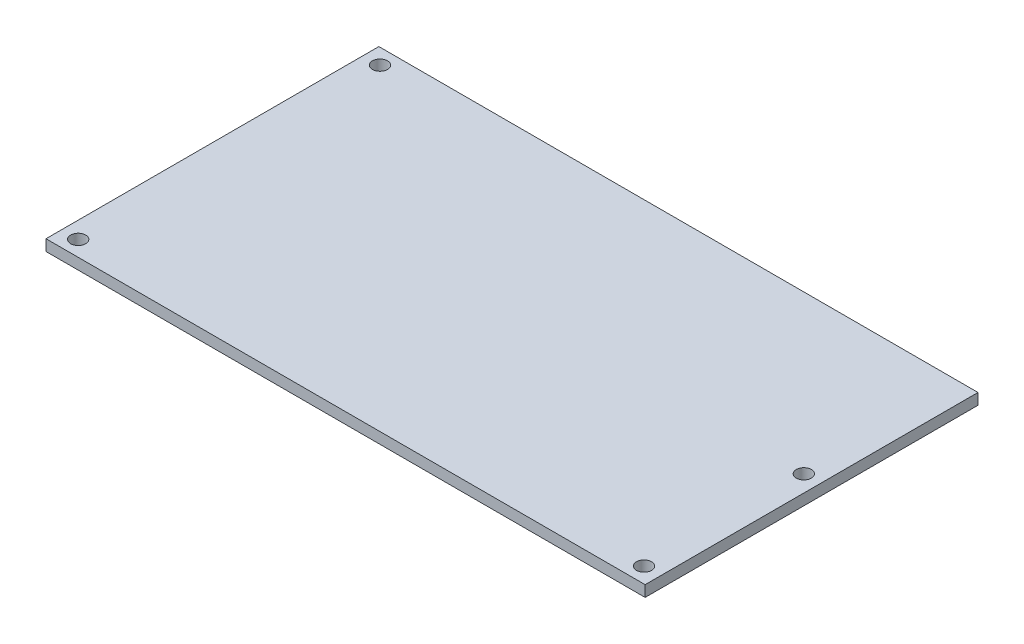
ISO-10303-21;
HEADER;
FILE_DESCRIPTION(('STEP AP214'),'2;1');
FILE_NAME('part.step','',(''),(''),'','','');
FILE_SCHEMA(('AUTOMOTIVE_DESIGN { 1 0 10303 214 1 1 1 1 }'));
ENDSEC;
DATA;
#1=APPLICATION_CONTEXT('core data for automotive mechanical design processes');
#2=APPLICATION_PROTOCOL_DEFINITION('international standard','automotive_design',2000,#1);
#3=PRODUCT_CONTEXT('',#1,'mechanical');
#4=PRODUCT('Part','Part','',(#3));
#5=PRODUCT_RELATED_PRODUCT_CATEGORY('part','',(#4));
#6=PRODUCT_DEFINITION_FORMATION('','',#4);
#7=PRODUCT_DEFINITION_CONTEXT('part definition',#1,'design');
#8=PRODUCT_DEFINITION('design','',#6,#7);
#9=PRODUCT_DEFINITION_SHAPE('','',#8);
#10=(LENGTH_UNIT() NAMED_UNIT(*) SI_UNIT(.MILLI.,.METRE.));
#11=(NAMED_UNIT(*) PLANE_ANGLE_UNIT() SI_UNIT($,.RADIAN.));
#12=(NAMED_UNIT(*) SI_UNIT($,.STERADIAN.) SOLID_ANGLE_UNIT());
#13=UNCERTAINTY_MEASURE_WITH_UNIT(LENGTH_MEASURE(1.E-05),#10,'distance_accuracy_value','');
#14=(GEOMETRIC_REPRESENTATION_CONTEXT(3) GLOBAL_UNCERTAINTY_ASSIGNED_CONTEXT((#13)) GLOBAL_UNIT_ASSIGNED_CONTEXT((#10,
#11,#12)) REPRESENTATION_CONTEXT('',''));
#15=CARTESIAN_POINT('',(0.,0.,0.));
#16=DIRECTION('',(0.,0.,1.));
#17=DIRECTION('',(1.,0.,0.));
#18=AXIS2_PLACEMENT_3D('',#15,#16,#17);
#19=CARTESIAN_POINT('',(0.,2.5,0.));
#20=DIRECTION('',(0.,1.,0.));
#21=DIRECTION('',(0.,0.,1.));
#22=AXIS2_PLACEMENT_3D('',#19,#20,#21);
#23=PLANE('',#22);
#24=CARTESIAN_POINT('',(-63.75,2.5,34.));
#25=DIRECTION('',(0.,1.,0.));
#26=DIRECTION('',(0.,0.,1.));
#27=AXIS2_PLACEMENT_3D('',#24,#25,#26);
#28=CIRCLE('',#27,1.7);
#29=CARTESIAN_POINT('',(-63.75,2.5,35.7));
#30=VERTEX_POINT('',#29);
#31=EDGE_CURVE('E123',#30,#30,#28,.T.);
#32=ORIENTED_EDGE('',*,*,#31,.F.);
#33=EDGE_LOOP('',(#32));
#34=FACE_BOUND('',#33,.T.);
#35=CARTESIAN_POINT('',(63.75,2.5,34.));
#36=DIRECTION('',(0.,1.,0.));
#37=DIRECTION('',(0.,0.,1.));
#38=AXIS2_PLACEMENT_3D('',#35,#36,#37);
#39=CIRCLE('',#38,1.7);
#40=CARTESIAN_POINT('',(63.75,2.5,35.7));
#41=VERTEX_POINT('',#40);
#42=EDGE_CURVE('E100',#41,#41,#39,.T.);
#43=ORIENTED_EDGE('',*,*,#42,.F.);
#44=EDGE_LOOP('',(#43));
#45=FACE_BOUND('',#44,.T.);
#46=DIRECTION('',(0.,0.,-1.));
#47=VECTOR('',#46,1.);
#48=CARTESIAN_POINT('',(67.5,2.5,-37.5));
#49=LINE('',#48,#47);
#50=CARTESIAN_POINT('',(67.5,2.5,37.5));
#51=VERTEX_POINT('',#50);
#52=CARTESIAN_POINT('',(67.5,2.5,-37.5));
#53=VERTEX_POINT('',#52);
#54=EDGE_CURVE('E85',#51,#53,#49,.T.);
#55=ORIENTED_EDGE('',*,*,#54,.T.);
#56=DIRECTION('',(-1.,0.,0.));
#57=VECTOR('',#56,1.);
#58=CARTESIAN_POINT('',(-67.5,2.5,-37.5));
#59=LINE('',#58,#57);
#60=CARTESIAN_POINT('',(-67.5,2.5,-37.5));
#61=VERTEX_POINT('',#60);
#62=EDGE_CURVE('E80',#53,#61,#59,.T.);
#63=ORIENTED_EDGE('',*,*,#62,.T.);
#64=DIRECTION('',(0.,0.,1.));
#65=VECTOR('',#64,1.);
#66=CARTESIAN_POINT('',(-67.5,2.5,-37.5));
#67=LINE('',#66,#65);
#68=CARTESIAN_POINT('',(-67.5,2.5,37.5));
#69=VERTEX_POINT('',#68);
#70=EDGE_CURVE('E83',#61,#69,#67,.T.);
#71=ORIENTED_EDGE('',*,*,#70,.T.);
#72=DIRECTION('',(1.,0.,0.));
#73=VECTOR('',#72,1.);
#74=CARTESIAN_POINT('',(-67.5,2.5,37.5));
#75=LINE('',#74,#73);
#76=EDGE_CURVE('E50',#69,#51,#75,.T.);
#77=ORIENTED_EDGE('',*,*,#76,.T.);
#78=EDGE_LOOP('',(#55,#63,#71,#77));
#79=FACE_BOUND('',#78,.T.);
#80=CARTESIAN_POINT('',(63.75,2.5,-1.99999999999999));
#81=DIRECTION('',(0.,1.,0.));
#82=DIRECTION('',(0.,0.,1.));
#83=AXIS2_PLACEMENT_3D('',#80,#81,#82);
#84=CIRCLE('',#83,1.7);
#85=CARTESIAN_POINT('',(63.75,2.5,-0.299999999999996));
#86=VERTEX_POINT('',#85);
#87=EDGE_CURVE('E117',#86,#86,#84,.T.);
#88=ORIENTED_EDGE('',*,*,#87,.F.);
#89=EDGE_LOOP('',(#88));
#90=FACE_BOUND('',#89,.T.);
#91=CARTESIAN_POINT('',(-63.75,2.5,-34.));
#92=DIRECTION('',(0.,1.,0.));
#93=DIRECTION('',(0.,0.,1.));
#94=AXIS2_PLACEMENT_3D('',#91,#92,#93);
#95=CIRCLE('',#94,1.7);
#96=CARTESIAN_POINT('',(-63.75,2.5,-32.3));
#97=VERTEX_POINT('',#96);
#98=EDGE_CURVE('E129',#97,#97,#95,.T.);
#99=ORIENTED_EDGE('',*,*,#98,.F.);
#100=EDGE_LOOP('',(#99));
#101=FACE_BOUND('',#100,.T.);
#102=ADVANCED_FACE('F33',(#34,#45,#79,#90,#101),#23,.T.);
#103=CARTESIAN_POINT('',(0.,0.,0.));
#104=DIRECTION('',(0.,1.,0.));
#105=DIRECTION('',(0.,0.,1.));
#106=AXIS2_PLACEMENT_3D('',#103,#104,#105);
#107=PLANE('',#106);
#108=CARTESIAN_POINT('',(-63.75,0.,34.));
#109=DIRECTION('',(0.,1.,0.));
#110=DIRECTION('',(0.,0.,-1.));
#111=AXIS2_PLACEMENT_3D('',#108,#109,#110);
#112=CIRCLE('',#111,1.7);
#113=CARTESIAN_POINT('',(-63.75,0.,32.3));
#114=VERTEX_POINT('',#113);
#115=EDGE_CURVE('E126',#114,#114,#112,.T.);
#116=ORIENTED_EDGE('',*,*,#115,.T.);
#117=EDGE_LOOP('',(#116));
#118=FACE_BOUND('',#117,.T.);
#119=CARTESIAN_POINT('',(63.75,0.,34.));
#120=DIRECTION('',(0.,1.,0.));
#121=DIRECTION('',(0.,0.,1.));
#122=AXIS2_PLACEMENT_3D('',#119,#120,#121);
#123=CIRCLE('',#122,1.7);
#124=CARTESIAN_POINT('',(63.75,0.,35.7));
#125=VERTEX_POINT('',#124);
#126=EDGE_CURVE('E114',#125,#125,#123,.T.);
#127=ORIENTED_EDGE('',*,*,#126,.T.);
#128=EDGE_LOOP('',(#127));
#129=FACE_BOUND('',#128,.T.);
#130=DIRECTION('',(0.,0.,-1.));
#131=VECTOR('',#130,1.);
#132=CARTESIAN_POINT('',(67.5,0.,-37.5));
#133=LINE('',#132,#131);
#134=CARTESIAN_POINT('',(67.5,0.,37.5));
#135=VERTEX_POINT('',#134);
#136=CARTESIAN_POINT('',(67.5,0.,-37.5));
#137=VERTEX_POINT('',#136);
#138=EDGE_CURVE('E97',#135,#137,#133,.T.);
#139=ORIENTED_EDGE('',*,*,#138,.F.);
#140=DIRECTION('',(1.,0.,0.));
#141=VECTOR('',#140,1.);
#142=CARTESIAN_POINT('',(-67.5,0.,37.5));
#143=LINE('',#142,#141);
#144=CARTESIAN_POINT('',(-67.5,0.,37.5));
#145=VERTEX_POINT('',#144);
#146=EDGE_CURVE('E73',#145,#135,#143,.T.);
#147=ORIENTED_EDGE('',*,*,#146,.F.);
#148=DIRECTION('',(0.,0.,1.));
#149=VECTOR('',#148,1.);
#150=CARTESIAN_POINT('',(-67.5,0.,-37.5));
#151=LINE('',#150,#149);
#152=CARTESIAN_POINT('',(-67.5,0.,-37.5));
#153=VERTEX_POINT('',#152);
#154=EDGE_CURVE('E67',#153,#145,#151,.T.);
#155=ORIENTED_EDGE('',*,*,#154,.F.);
#156=DIRECTION('',(-1.,0.,0.));
#157=VECTOR('',#156,1.);
#158=CARTESIAN_POINT('',(-67.5,0.,-37.5));
#159=LINE('',#158,#157);
#160=EDGE_CURVE('E89',#137,#153,#159,.T.);
#161=ORIENTED_EDGE('',*,*,#160,.F.);
#162=EDGE_LOOP('',(#139,#147,#155,#161));
#163=FACE_BOUND('',#162,.T.);
#164=CARTESIAN_POINT('',(63.75,0.,-1.99999999999999));
#165=DIRECTION('',(0.,1.,0.));
#166=DIRECTION('',(0.,0.,1.));
#167=AXIS2_PLACEMENT_3D('',#164,#165,#166);
#168=CIRCLE('',#167,1.7);
#169=CARTESIAN_POINT('',(63.75,0.,-0.299999999999996));
#170=VERTEX_POINT('',#169);
#171=EDGE_CURVE('E120',#170,#170,#168,.T.);
#172=ORIENTED_EDGE('',*,*,#171,.T.);
#173=EDGE_LOOP('',(#172));
#174=FACE_BOUND('',#173,.T.);
#175=CARTESIAN_POINT('',(-63.75,0.,-34.));
#176=DIRECTION('',(0.,1.,0.));
#177=DIRECTION('',(0.,0.,1.));
#178=AXIS2_PLACEMENT_3D('',#175,#176,#177);
#179=CIRCLE('',#178,1.7);
#180=CARTESIAN_POINT('',(-63.75,0.,-32.3));
#181=VERTEX_POINT('',#180);
#182=EDGE_CURVE('E132',#181,#181,#179,.T.);
#183=ORIENTED_EDGE('',*,*,#182,.T.);
#184=EDGE_LOOP('',(#183));
#185=FACE_BOUND('',#184,.T.);
#186=ADVANCED_FACE('F108',(#118,#129,#163,#174,#185),#107,.F.);
#187=CARTESIAN_POINT('',(67.5,2.5,-37.5));
#188=DIRECTION('',(-1.,0.,0.));
#189=DIRECTION('',(0.,0.,1.));
#190=AXIS2_PLACEMENT_3D('',#187,#188,#189);
#191=PLANE('',#190);
#192=ORIENTED_EDGE('',*,*,#138,.T.);
#193=DIRECTION('',(0.,-1.,0.));
#194=VECTOR('',#193,1.);
#195=CARTESIAN_POINT('',(67.5,2.5,-37.5));
#196=LINE('',#195,#194);
#197=EDGE_CURVE('E11',#53,#137,#196,.T.);
#198=ORIENTED_EDGE('',*,*,#197,.F.);
#199=ORIENTED_EDGE('',*,*,#54,.F.);
#200=DIRECTION('',(0.,-1.,0.));
#201=VECTOR('',#200,1.);
#202=CARTESIAN_POINT('',(67.5,2.5,37.5));
#203=LINE('',#202,#201);
#204=EDGE_CURVE('E93',#51,#135,#203,.T.);
#205=ORIENTED_EDGE('',*,*,#204,.T.);
#206=EDGE_LOOP('',(#192,#198,#199,#205));
#207=FACE_BOUND('',#206,.T.);
#208=ADVANCED_FACE('F35',(#207),#191,.F.);
#209=CARTESIAN_POINT('',(-67.5,2.5,-37.5));
#210=DIRECTION('',(0.,0.,1.));
#211=DIRECTION('',(1.,0.,0.));
#212=AXIS2_PLACEMENT_3D('',#209,#210,#211);
#213=PLANE('',#212);
#214=ORIENTED_EDGE('',*,*,#160,.T.);
#215=DIRECTION('',(0.,-1.,0.));
#216=VECTOR('',#215,1.);
#217=CARTESIAN_POINT('',(-67.5,2.5,-37.5));
#218=LINE('',#217,#216);
#219=EDGE_CURVE('E42',#61,#153,#218,.T.);
#220=ORIENTED_EDGE('',*,*,#219,.F.);
#221=ORIENTED_EDGE('',*,*,#62,.F.);
#222=ORIENTED_EDGE('',*,*,#197,.T.);
#223=EDGE_LOOP('',(#214,#220,#221,#222));
#224=FACE_BOUND('',#223,.T.);
#225=ADVANCED_FACE('F88',(#224),#213,.F.);
#226=CARTESIAN_POINT('',(-67.5,2.5,-37.5));
#227=DIRECTION('',(1.,0.,0.));
#228=DIRECTION('',(0.,0.,-1.));
#229=AXIS2_PLACEMENT_3D('',#226,#227,#228);
#230=PLANE('',#229);
#231=ORIENTED_EDGE('',*,*,#154,.T.);
#232=DIRECTION('',(0.,-1.,0.));
#233=VECTOR('',#232,1.);
#234=CARTESIAN_POINT('',(-67.5,2.5,37.5));
#235=LINE('',#234,#233);
#236=EDGE_CURVE('E90',#69,#145,#235,.T.);
#237=ORIENTED_EDGE('',*,*,#236,.F.);
#238=ORIENTED_EDGE('',*,*,#70,.F.);
#239=ORIENTED_EDGE('',*,*,#219,.T.);
#240=EDGE_LOOP('',(#231,#237,#238,#239));
#241=FACE_BOUND('',#240,.T.);
#242=ADVANCED_FACE('F91',(#241),#230,.F.);
#243=CARTESIAN_POINT('',(-67.5,2.5,37.5));
#244=DIRECTION('',(0.,0.,-1.));
#245=DIRECTION('',(-1.,0.,0.));
#246=AXIS2_PLACEMENT_3D('',#243,#244,#245);
#247=PLANE('',#246);
#248=ORIENTED_EDGE('',*,*,#146,.T.);
#249=ORIENTED_EDGE('',*,*,#204,.F.);
#250=ORIENTED_EDGE('',*,*,#76,.F.);
#251=ORIENTED_EDGE('',*,*,#236,.T.);
#252=EDGE_LOOP('',(#248,#249,#250,#251));
#253=FACE_BOUND('',#252,.T.);
#254=ADVANCED_FACE('F105',(#253),#247,.F.);
#255=CARTESIAN_POINT('',(63.75,2.501,34.));
#256=DIRECTION('',(0.,-1.,0.));
#257=DIRECTION('',(0.,0.,-1.));
#258=AXIS2_PLACEMENT_3D('',#255,#256,#257);
#259=CYLINDRICAL_SURFACE('',#258,1.7);
#260=ORIENTED_EDGE('',*,*,#42,.T.);
#261=EDGE_LOOP('',(#260));
#262=FACE_BOUND('',#261,.T.);
#263=ORIENTED_EDGE('',*,*,#126,.F.);
#264=EDGE_LOOP('',(#263));
#265=FACE_BOUND('',#264,.T.);
#266=ADVANCED_FACE('F159',(#262,#265),#259,.F.);
#267=CARTESIAN_POINT('',(63.75,2.501,-1.99999999999999));
#268=DIRECTION('',(0.,-1.,0.));
#269=DIRECTION('',(0.,0.,-1.));
#270=AXIS2_PLACEMENT_3D('',#267,#268,#269);
#271=CYLINDRICAL_SURFACE('',#270,1.7);
#272=ORIENTED_EDGE('',*,*,#87,.T.);
#273=EDGE_LOOP('',(#272));
#274=FACE_BOUND('',#273,.T.);
#275=ORIENTED_EDGE('',*,*,#171,.F.);
#276=EDGE_LOOP('',(#275));
#277=FACE_BOUND('',#276,.T.);
#278=ADVANCED_FACE('F145',(#274,#277),#271,.F.);
#279=CARTESIAN_POINT('',(-63.75,2.501,34.));
#280=DIRECTION('',(0.,-1.,0.));
#281=DIRECTION('',(0.,0.,-1.));
#282=AXIS2_PLACEMENT_3D('',#279,#280,#281);
#283=CYLINDRICAL_SURFACE('',#282,1.7);
#284=ORIENTED_EDGE('',*,*,#31,.T.);
#285=EDGE_LOOP('',(#284));
#286=FACE_BOUND('',#285,.T.);
#287=ORIENTED_EDGE('',*,*,#115,.F.);
#288=EDGE_LOOP('',(#287));
#289=FACE_BOUND('',#288,.T.);
#290=ADVANCED_FACE('F139',(#286,#289),#283,.F.);
#291=CARTESIAN_POINT('',(-63.75,2.501,-34.));
#292=DIRECTION('',(0.,-1.,0.));
#293=DIRECTION('',(0.,0.,-1.));
#294=AXIS2_PLACEMENT_3D('',#291,#292,#293);
#295=CYLINDRICAL_SURFACE('',#294,1.7);
#296=ORIENTED_EDGE('',*,*,#98,.T.);
#297=EDGE_LOOP('',(#296));
#298=FACE_BOUND('',#297,.T.);
#299=ORIENTED_EDGE('',*,*,#182,.F.);
#300=EDGE_LOOP('',(#299));
#301=FACE_BOUND('',#300,.T.);
#302=ADVANCED_FACE('F137',(#298,#301),#295,.F.);
#303=CLOSED_SHELL('',(#102,#186,#208,#225,#242,#254,#266,#278,#290,#302));
#304=MANIFOLD_SOLID_BREP('B2',#303);
#305=ADVANCED_BREP_SHAPE_REPRESENTATION('',(#18,#304),#14);
#306=SHAPE_DEFINITION_REPRESENTATION(#9,#305);
ENDSEC;
END-ISO-10303-21;
